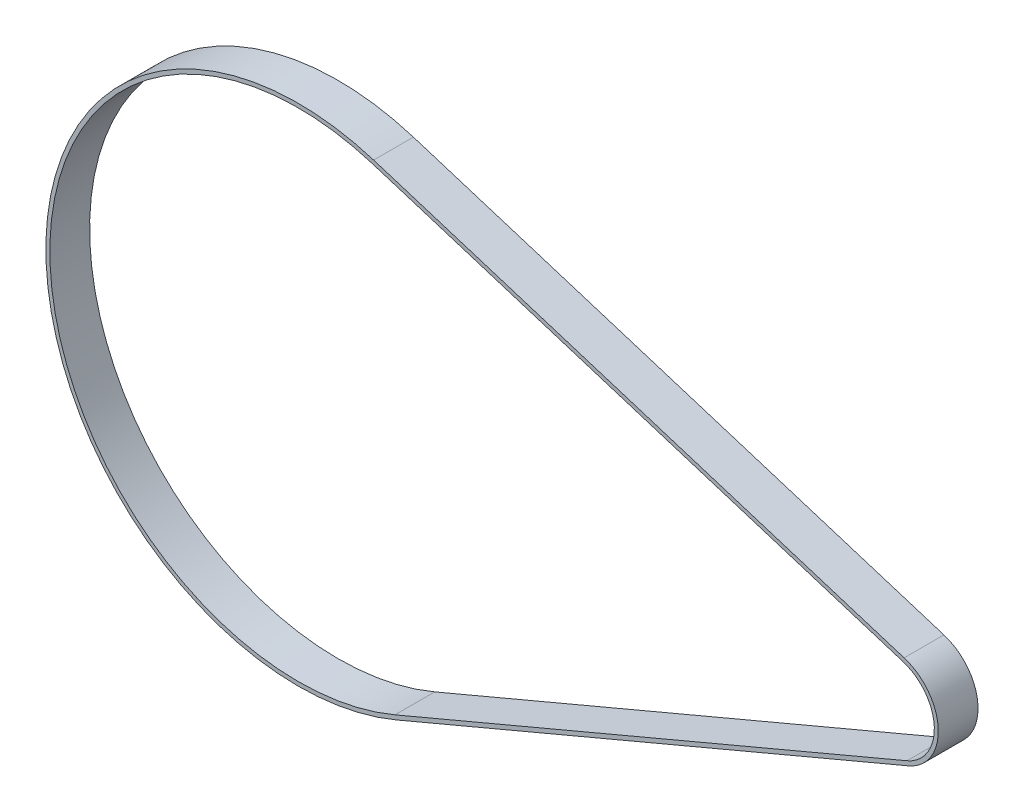
ISO-10303-21;
HEADER;
FILE_DESCRIPTION(('STEP AP214'),'2;1');
FILE_NAME('part.step','',(''),(''),'','','');
FILE_SCHEMA(('AUTOMOTIVE_DESIGN { 1 0 10303 214 1 1 1 1 }'));
ENDSEC;
DATA;
#1=APPLICATION_CONTEXT('core data for automotive mechanical design processes');
#2=APPLICATION_PROTOCOL_DEFINITION('international standard','automotive_design',2000,#1);
#3=PRODUCT_CONTEXT('',#1,'mechanical');
#4=PRODUCT('Part','Part','',(#3));
#5=PRODUCT_RELATED_PRODUCT_CATEGORY('part','',(#4));
#6=PRODUCT_DEFINITION_FORMATION('','',#4);
#7=PRODUCT_DEFINITION_CONTEXT('part definition',#1,'design');
#8=PRODUCT_DEFINITION('design','',#6,#7);
#9=PRODUCT_DEFINITION_SHAPE('','',#8);
#10=(LENGTH_UNIT() NAMED_UNIT(*) SI_UNIT(.MILLI.,.METRE.));
#11=(NAMED_UNIT(*) PLANE_ANGLE_UNIT() SI_UNIT($,.RADIAN.));
#12=(NAMED_UNIT(*) SI_UNIT($,.STERADIAN.) SOLID_ANGLE_UNIT());
#13=UNCERTAINTY_MEASURE_WITH_UNIT(LENGTH_MEASURE(1.E-05),#10,'distance_accuracy_value','');
#14=(GEOMETRIC_REPRESENTATION_CONTEXT(3) GLOBAL_UNCERTAINTY_ASSIGNED_CONTEXT((#13)) GLOBAL_UNIT_ASSIGNED_CONTEXT((#10,
#11,#12)) REPRESENTATION_CONTEXT('',''));
#15=CARTESIAN_POINT('',(0.,0.,0.));
#16=DIRECTION('',(0.,0.,1.));
#17=DIRECTION('',(1.,0.,0.));
#18=AXIS2_PLACEMENT_3D('',#15,#16,#17);
#19=CARTESIAN_POINT('',(0.,3.29112685364806E-13,10.));
#20=DIRECTION('',(0.,0.,-1.));
#21=DIRECTION('',(-1.,0.,0.));
#22=AXIS2_PLACEMENT_3D('',#19,#20,#21);
#23=PLANE('',#22);
#24=CARTESIAN_POINT('',(0.,3.29112685364806E-13,10.));
#25=DIRECTION('',(0.,0.,-1.));
#26=DIRECTION('',(-1.,0.,0.));
#27=AXIS2_PLACEMENT_3D('',#24,#25,#26);
#28=CIRCLE('',#27,127.);
#29=CARTESIAN_POINT('',(37.8958947656661,121.214277871502,10.));
#30=VERTEX_POINT('',#29);
#31=CARTESIAN_POINT('',(49.4126282521839,-116.993128726483,10.));
#32=VERTEX_POINT('',#31);
#33=EDGE_CURVE('E160',#30,#32,#28,.F.);
#34=ORIENTED_EDGE('',*,*,#33,.T.);
#35=DIRECTION('',(0.921205738003805,0.389075813009322,0.));
#36=VECTOR('',#35,1.);
#37=CARTESIAN_POINT('',(49.4126282521839,-116.993128726483,10.));
#38=LINE('',#37,#36);
#39=CARTESIAN_POINT('',(307.032357418728,-8.18615821204091,10.));
#40=VERTEX_POINT('',#39);
#41=EDGE_CURVE('E163',#32,#40,#38,.T.);
#42=ORIENTED_EDGE('',*,*,#41,.T.);
#43=CARTESIAN_POINT('',(297.5,14.3833823690523,10.));
#44=DIRECTION('',(0.,0.,-1.));
#45=DIRECTION('',(-1.,0.,0.));
#46=AXIS2_PLACEMENT_3D('',#43,#44,#45);
#47=CIRCLE('',#46,24.5);
#48=CARTESIAN_POINT('',(304.81062536818,37.7672391237908,10.));
#49=VERTEX_POINT('',#48);
#50=EDGE_CURVE('E166',#40,#49,#47,.F.);
#51=ORIENTED_EDGE('',*,*,#50,.T.);
#52=DIRECTION('',(-0.954443132846468,0.2983928721706,0.));
#53=VECTOR('',#52,1.);
#54=CARTESIAN_POINT('',(37.8958947656661,121.214277871502,10.));
#55=LINE('',#54,#53);
#56=EDGE_CURVE('E168',#49,#30,#55,.T.);
#57=ORIENTED_EDGE('',*,*,#56,.T.);
#58=EDGE_LOOP('',(#34,#42,#51,#57));
#59=FACE_BOUND('',#58,.T.);
#60=CARTESIAN_POINT('',(0.,3.29112685364806E-13,10.));
#61=DIRECTION('',(0.,0.,1.));
#62=DIRECTION('',(-1.,0.,0.));
#63=AXIS2_PLACEMENT_3D('',#60,#61,#62);
#64=CIRCLE('',#63,125.);
#65=CARTESIAN_POINT('',(37.2991090213249,119.305391605809,10.));
#66=VERTEX_POINT('',#65);
#67=CARTESIAN_POINT('',(48.6344766261652,-115.150717250475,10.));
#68=VERTEX_POINT('',#67);
#69=EDGE_CURVE('E124',#66,#68,#64,.T.);
#70=ORIENTED_EDGE('',*,*,#69,.F.);
#71=DIRECTION('',(-0.954443132846468,0.2983928721706,0.));
#72=VECTOR('',#71,1.);
#73=CARTESIAN_POINT('',(37.2991090213249,119.305391605809,10.));
#74=LINE('',#73,#72);
#75=CARTESIAN_POINT('',(304.213839623838,35.8583528580978,10.));
#76=VERTEX_POINT('',#75);
#77=EDGE_CURVE('E146',#76,#66,#74,.T.);
#78=ORIENTED_EDGE('',*,*,#77,.F.);
#79=CARTESIAN_POINT('',(297.5,14.3833823690523,10.));
#80=DIRECTION('',(0.,0.,1.));
#81=DIRECTION('',(-1.,0.,0.));
#82=AXIS2_PLACEMENT_3D('',#79,#80,#81);
#83=CIRCLE('',#82,22.5);
#84=CARTESIAN_POINT('',(306.25420579271,-6.3437467360333,10.));
#85=VERTEX_POINT('',#84);
#86=EDGE_CURVE('E144',#85,#76,#83,.T.);
#87=ORIENTED_EDGE('',*,*,#86,.F.);
#88=DIRECTION('',(0.921205738003805,0.389075813009322,0.));
#89=VECTOR('',#88,1.);
#90=CARTESIAN_POINT('',(306.25420579271,-6.3437467360333,10.));
#91=LINE('',#90,#89);
#92=EDGE_CURVE('E132',#68,#85,#91,.T.);
#93=ORIENTED_EDGE('',*,*,#92,.F.);
#94=EDGE_LOOP('',(#70,#78,#87,#93));
#95=FACE_BOUND('',#94,.T.);
#96=ADVANCED_FACE('F59',(#59,#95),#23,.F.);
#97=CARTESIAN_POINT('',(0.,3.29112685364806E-13,-10.));
#98=DIRECTION('',(0.,0.,-1.));
#99=DIRECTION('',(-1.,0.,0.));
#100=AXIS2_PLACEMENT_3D('',#97,#98,#99);
#101=PLANE('',#100);
#102=CARTESIAN_POINT('',(0.,3.29112685364806E-13,-10.));
#103=DIRECTION('',(0.,0.,-1.));
#104=DIRECTION('',(-1.,0.,0.));
#105=AXIS2_PLACEMENT_3D('',#102,#103,#104);
#106=CIRCLE('',#105,127.);
#107=CARTESIAN_POINT('',(37.8958947656661,121.214277871502,-10.));
#108=VERTEX_POINT('',#107);
#109=CARTESIAN_POINT('',(49.4126282521839,-116.993128726483,-10.));
#110=VERTEX_POINT('',#109);
#111=EDGE_CURVE('E140',#108,#110,#106,.F.);
#112=ORIENTED_EDGE('',*,*,#111,.F.);
#113=DIRECTION('',(-0.954443132846468,0.2983928721706,0.));
#114=VECTOR('',#113,1.);
#115=CARTESIAN_POINT('',(37.8958947656661,121.214277871502,-10.));
#116=LINE('',#115,#114);
#117=CARTESIAN_POINT('',(304.81062536818,37.7672391237908,-10.));
#118=VERTEX_POINT('',#117);
#119=EDGE_CURVE('E164',#118,#108,#116,.T.);
#120=ORIENTED_EDGE('',*,*,#119,.F.);
#121=CARTESIAN_POINT('',(297.5,14.3833823690523,-10.));
#122=DIRECTION('',(0.,0.,-1.));
#123=DIRECTION('',(-1.,0.,0.));
#124=AXIS2_PLACEMENT_3D('',#121,#122,#123);
#125=CIRCLE('',#124,24.5);
#126=CARTESIAN_POINT('',(307.032357418728,-8.18615821204091,-10.));
#127=VERTEX_POINT('',#126);
#128=EDGE_CURVE('E175',#127,#118,#125,.F.);
#129=ORIENTED_EDGE('',*,*,#128,.F.);
#130=DIRECTION('',(0.921205738003805,0.389075813009322,0.));
#131=VECTOR('',#130,1.);
#132=CARTESIAN_POINT('',(49.4126282521839,-116.993128726483,-10.));
#133=LINE('',#132,#131);
#134=EDGE_CURVE('E173',#110,#127,#133,.T.);
#135=ORIENTED_EDGE('',*,*,#134,.F.);
#136=EDGE_LOOP('',(#112,#120,#129,#135));
#137=FACE_BOUND('',#136,.T.);
#138=DIRECTION('',(-0.954443132846468,0.2983928721706,0.));
#139=VECTOR('',#138,1.);
#140=CARTESIAN_POINT('',(37.2991090213249,119.305391605809,-10.));
#141=LINE('',#140,#139);
#142=CARTESIAN_POINT('',(304.213839623838,35.8583528580978,-10.));
#143=VERTEX_POINT('',#142);
#144=CARTESIAN_POINT('',(37.2991090213249,119.305391605809,-10.));
#145=VERTEX_POINT('',#144);
#146=EDGE_CURVE('E133',#143,#145,#141,.T.);
#147=ORIENTED_EDGE('',*,*,#146,.T.);
#148=CARTESIAN_POINT('',(0.,3.29112685364806E-13,-10.));
#149=DIRECTION('',(0.,0.,1.));
#150=DIRECTION('',(-1.,0.,0.));
#151=AXIS2_PLACEMENT_3D('',#148,#149,#150);
#152=CIRCLE('',#151,125.);
#153=CARTESIAN_POINT('',(48.6344766261652,-115.150717250475,-10.));
#154=VERTEX_POINT('',#153);
#155=EDGE_CURVE('E82',#145,#154,#152,.T.);
#156=ORIENTED_EDGE('',*,*,#155,.T.);
#157=DIRECTION('',(0.921205738003805,0.389075813009322,0.));
#158=VECTOR('',#157,1.);
#159=CARTESIAN_POINT('',(306.25420579271,-6.3437467360333,-10.));
#160=LINE('',#159,#158);
#161=CARTESIAN_POINT('',(306.25420579271,-6.3437467360333,-10.));
#162=VERTEX_POINT('',#161);
#163=EDGE_CURVE('E139',#154,#162,#160,.T.);
#164=ORIENTED_EDGE('',*,*,#163,.T.);
#165=CARTESIAN_POINT('',(297.5,14.3833823690523,-10.));
#166=DIRECTION('',(0.,0.,1.));
#167=DIRECTION('',(-1.,0.,0.));
#168=AXIS2_PLACEMENT_3D('',#165,#166,#167);
#169=CIRCLE('',#168,22.5);
#170=EDGE_CURVE('E152',#162,#143,#169,.T.);
#171=ORIENTED_EDGE('',*,*,#170,.T.);
#172=EDGE_LOOP('',(#147,#156,#164,#171));
#173=FACE_BOUND('',#172,.T.);
#174=ADVANCED_FACE('F193',(#137,#173),#101,.T.);
#175=CARTESIAN_POINT('',(0.,3.29112685364806E-13,10.));
#176=DIRECTION('',(0.,0.,-1.));
#177=DIRECTION('',(-1.,0.,0.));
#178=AXIS2_PLACEMENT_3D('',#175,#176,#177);
#179=CYLINDRICAL_SURFACE('',#178,127.);
#180=ORIENTED_EDGE('',*,*,#111,.T.);
#181=DIRECTION('',(0.,0.,-1.));
#182=VECTOR('',#181,1.);
#183=CARTESIAN_POINT('',(49.4126282521839,-116.993128726483,10.));
#184=LINE('',#183,#182);
#185=EDGE_CURVE('E12',#32,#110,#184,.T.);
#186=ORIENTED_EDGE('',*,*,#185,.F.);
#187=ORIENTED_EDGE('',*,*,#33,.F.);
#188=DIRECTION('',(0.,0.,-1.));
#189=VECTOR('',#188,1.);
#190=CARTESIAN_POINT('',(37.8958947656661,121.214277871502,10.));
#191=LINE('',#190,#189);
#192=EDGE_CURVE('E170',#30,#108,#191,.T.);
#193=ORIENTED_EDGE('',*,*,#192,.T.);
#194=EDGE_LOOP('',(#180,#186,#187,#193));
#195=FACE_BOUND('',#194,.T.);
#196=ADVANCED_FACE('F61',(#195),#179,.T.);
#197=CARTESIAN_POINT('',(49.4126282521839,-116.993128726483,10.));
#198=DIRECTION('',(-0.389075813009322,0.921205738003805,0.));
#199=DIRECTION('',(-0.921205738003805,-0.389075813009322,0.));
#200=AXIS2_PLACEMENT_3D('',#197,#198,#199);
#201=PLANE('',#200);
#202=ORIENTED_EDGE('',*,*,#134,.T.);
#203=DIRECTION('',(0.,0.,-1.));
#204=VECTOR('',#203,1.);
#205=CARTESIAN_POINT('',(307.032357418728,-8.18615821204091,10.));
#206=LINE('',#205,#204);
#207=EDGE_CURVE('E67',#40,#127,#206,.T.);
#208=ORIENTED_EDGE('',*,*,#207,.F.);
#209=ORIENTED_EDGE('',*,*,#41,.F.);
#210=ORIENTED_EDGE('',*,*,#185,.T.);
#211=EDGE_LOOP('',(#202,#208,#209,#210));
#212=FACE_BOUND('',#211,.T.);
#213=ADVANCED_FACE('F203',(#212),#201,.F.);
#214=CARTESIAN_POINT('',(297.5,14.3833823690523,10.));
#215=DIRECTION('',(0.,0.,-1.));
#216=DIRECTION('',(-1.,0.,0.));
#217=AXIS2_PLACEMENT_3D('',#214,#215,#216);
#218=CYLINDRICAL_SURFACE('',#217,24.5);
#219=ORIENTED_EDGE('',*,*,#128,.T.);
#220=DIRECTION('',(0.,0.,-1.));
#221=VECTOR('',#220,1.);
#222=CARTESIAN_POINT('',(304.81062536818,37.7672391237908,10.));
#223=LINE('',#222,#221);
#224=EDGE_CURVE('E180',#49,#118,#223,.T.);
#225=ORIENTED_EDGE('',*,*,#224,.F.);
#226=ORIENTED_EDGE('',*,*,#50,.F.);
#227=ORIENTED_EDGE('',*,*,#207,.T.);
#228=EDGE_LOOP('',(#219,#225,#226,#227));
#229=FACE_BOUND('',#228,.T.);
#230=ADVANCED_FACE('F187',(#229),#218,.T.);
#231=CARTESIAN_POINT('',(37.8958947656661,121.214277871502,10.));
#232=DIRECTION('',(-0.2983928721706,-0.954443132846468,0.));
#233=DIRECTION('',(0.954443132846468,-0.2983928721706,0.));
#234=AXIS2_PLACEMENT_3D('',#231,#232,#233);
#235=PLANE('',#234);
#236=ORIENTED_EDGE('',*,*,#119,.T.);
#237=ORIENTED_EDGE('',*,*,#192,.F.);
#238=ORIENTED_EDGE('',*,*,#56,.F.);
#239=ORIENTED_EDGE('',*,*,#224,.T.);
#240=EDGE_LOOP('',(#236,#237,#238,#239));
#241=FACE_BOUND('',#240,.T.);
#242=ADVANCED_FACE('F197',(#241),#235,.F.);
#243=CARTESIAN_POINT('',(0.,3.29112685364806E-13,10.));
#244=DIRECTION('',(0.,0.,-1.));
#245=DIRECTION('',(-1.,0.,0.));
#246=AXIS2_PLACEMENT_3D('',#243,#244,#245);
#247=CYLINDRICAL_SURFACE('',#246,125.);
#248=ORIENTED_EDGE('',*,*,#155,.F.);
#249=DIRECTION('',(0.,0.,-1.));
#250=VECTOR('',#249,1.);
#251=CARTESIAN_POINT('',(37.2991090213249,119.305391605809,10.));
#252=LINE('',#251,#250);
#253=EDGE_CURVE('E128',#66,#145,#252,.T.);
#254=ORIENTED_EDGE('',*,*,#253,.F.);
#255=ORIENTED_EDGE('',*,*,#69,.T.);
#256=DIRECTION('',(0.,0.,-1.));
#257=VECTOR('',#256,1.);
#258=CARTESIAN_POINT('',(48.6344766261652,-115.150717250475,10.));
#259=LINE('',#258,#257);
#260=EDGE_CURVE('E127',#68,#154,#259,.T.);
#261=ORIENTED_EDGE('',*,*,#260,.T.);
#262=EDGE_LOOP('',(#248,#254,#255,#261));
#263=FACE_BOUND('',#262,.T.);
#264=ADVANCED_FACE('F126',(#263),#247,.F.);
#265=CARTESIAN_POINT('',(306.25420579271,-6.3437467360333,10.));
#266=DIRECTION('',(-0.389075813009322,0.921205738003805,0.));
#267=DIRECTION('',(-0.921205738003805,-0.389075813009322,0.));
#268=AXIS2_PLACEMENT_3D('',#265,#266,#267);
#269=PLANE('',#268);
#270=ORIENTED_EDGE('',*,*,#163,.F.);
#271=ORIENTED_EDGE('',*,*,#260,.F.);
#272=ORIENTED_EDGE('',*,*,#92,.T.);
#273=DIRECTION('',(0.,0.,-1.));
#274=VECTOR('',#273,1.);
#275=CARTESIAN_POINT('',(306.25420579271,-6.3437467360333,10.));
#276=LINE('',#275,#274);
#277=EDGE_CURVE('E141',#85,#162,#276,.T.);
#278=ORIENTED_EDGE('',*,*,#277,.T.);
#279=EDGE_LOOP('',(#270,#271,#272,#278));
#280=FACE_BOUND('',#279,.T.);
#281=ADVANCED_FACE('F136',(#280),#269,.T.);
#282=CARTESIAN_POINT('',(297.5,14.3833823690523,10.));
#283=DIRECTION('',(0.,0.,-1.));
#284=DIRECTION('',(-1.,0.,0.));
#285=AXIS2_PLACEMENT_3D('',#282,#283,#284);
#286=CYLINDRICAL_SURFACE('',#285,22.5);
#287=ORIENTED_EDGE('',*,*,#170,.F.);
#288=ORIENTED_EDGE('',*,*,#277,.F.);
#289=ORIENTED_EDGE('',*,*,#86,.T.);
#290=DIRECTION('',(0.,0.,-1.));
#291=VECTOR('',#290,1.);
#292=CARTESIAN_POINT('',(304.213839623838,35.8583528580978,10.));
#293=LINE('',#292,#291);
#294=EDGE_CURVE('E74',#76,#143,#293,.T.);
#295=ORIENTED_EDGE('',*,*,#294,.T.);
#296=EDGE_LOOP('',(#287,#288,#289,#295));
#297=FACE_BOUND('',#296,.T.);
#298=ADVANCED_FACE('F226',(#297),#286,.F.);
#299=CARTESIAN_POINT('',(37.2991090213249,119.305391605809,10.));
#300=DIRECTION('',(-0.2983928721706,-0.954443132846468,0.));
#301=DIRECTION('',(0.954443132846468,-0.2983928721706,0.));
#302=AXIS2_PLACEMENT_3D('',#299,#300,#301);
#303=PLANE('',#302);
#304=ORIENTED_EDGE('',*,*,#146,.F.);
#305=ORIENTED_EDGE('',*,*,#294,.F.);
#306=ORIENTED_EDGE('',*,*,#77,.T.);
#307=ORIENTED_EDGE('',*,*,#253,.T.);
#308=EDGE_LOOP('',(#304,#305,#306,#307));
#309=FACE_BOUND('',#308,.T.);
#310=ADVANCED_FACE('F230',(#309),#303,.T.);
#311=CLOSED_SHELL('',(#96,#174,#196,#213,#230,#242,#264,#281,#298,#310));
#312=MANIFOLD_SOLID_BREP('B2',#311);
#313=ADVANCED_BREP_SHAPE_REPRESENTATION('',(#18,#312),#14);
#314=SHAPE_DEFINITION_REPRESENTATION(#9,#313);
ENDSEC;
END-ISO-10303-21;
